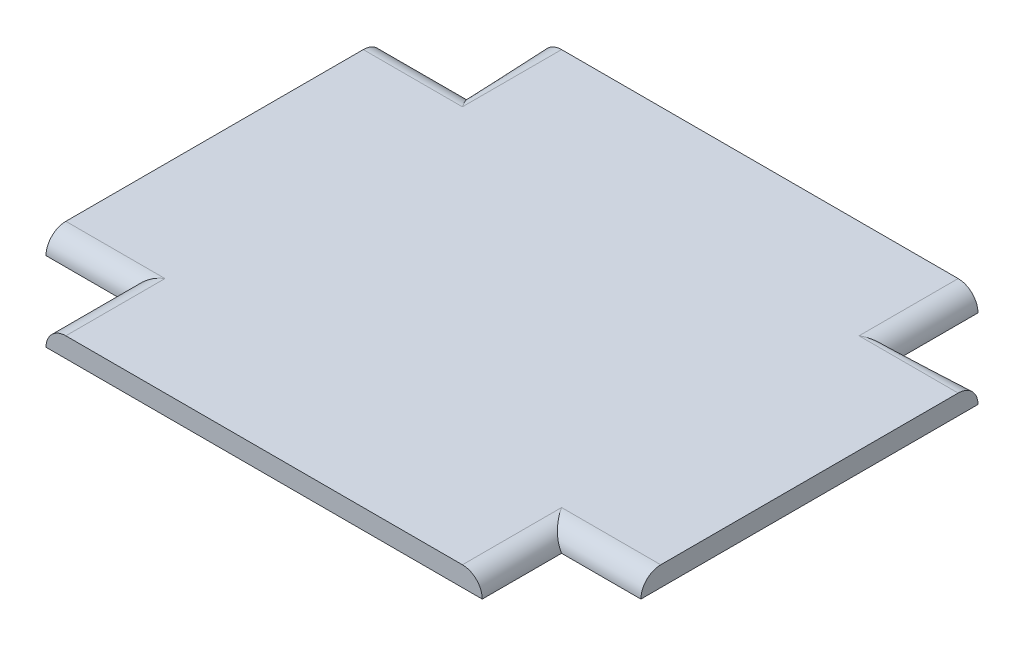
ISO-10303-21;
HEADER;
FILE_DESCRIPTION(('STEP AP214'),'2;1');
FILE_NAME('part.step','',(''),(''),'','','');
FILE_SCHEMA(('AUTOMOTIVE_DESIGN { 1 0 10303 214 1 1 1 1 }'));
ENDSEC;
DATA;
#1=APPLICATION_CONTEXT('core data for automotive mechanical design processes');
#2=APPLICATION_PROTOCOL_DEFINITION('international standard','automotive_design',2000,#1);
#3=PRODUCT_CONTEXT('',#1,'mechanical');
#4=PRODUCT('Part','Part','',(#3));
#5=PRODUCT_RELATED_PRODUCT_CATEGORY('part','',(#4));
#6=PRODUCT_DEFINITION_FORMATION('','',#4);
#7=PRODUCT_DEFINITION_CONTEXT('part definition',#1,'design');
#8=PRODUCT_DEFINITION('design','',#6,#7);
#9=PRODUCT_DEFINITION_SHAPE('','',#8);
#10=(LENGTH_UNIT() NAMED_UNIT(*) SI_UNIT(.MILLI.,.METRE.));
#11=(NAMED_UNIT(*) PLANE_ANGLE_UNIT() SI_UNIT($,.RADIAN.));
#12=(NAMED_UNIT(*) SI_UNIT($,.STERADIAN.) SOLID_ANGLE_UNIT());
#13=UNCERTAINTY_MEASURE_WITH_UNIT(LENGTH_MEASURE(1.E-05),#10,'distance_accuracy_value','');
#14=(GEOMETRIC_REPRESENTATION_CONTEXT(3) GLOBAL_UNCERTAINTY_ASSIGNED_CONTEXT((#13)) GLOBAL_UNIT_ASSIGNED_CONTEXT((#10,
#11,#12)) REPRESENTATION_CONTEXT('',''));
#15=CARTESIAN_POINT('',(0.,0.,0.));
#16=DIRECTION('',(0.,0.,1.));
#17=DIRECTION('',(1.,0.,0.));
#18=AXIS2_PLACEMENT_3D('',#15,#16,#17);
#19=CARTESIAN_POINT('',(-0.2,0.18,0.21));
#20=DIRECTION('',(0.,0.,1.));
#21=DIRECTION('',(-0.707106781186548,0.707106781186548,0.));
#22=AXIS2_PLACEMENT_3D('',#19,#20,#21);
#23=CYLINDRICAL_SURFACE('',#22,0.02);
#24=DIRECTION('',(0.,0.,-1.));
#25=VECTOR('',#24,1.);
#26=CARTESIAN_POINT('',(-0.22,0.18,0.21));
#27=LINE('',#26,#25);
#28=CARTESIAN_POINT('',(-0.22,0.18,0.5));
#29=VERTEX_POINT('',#28);
#30=CARTESIAN_POINT('',(-0.22,0.18,0.42));
#31=VERTEX_POINT('',#30);
#32=EDGE_CURVE('E11',#29,#31,#27,.T.);
#33=ORIENTED_EDGE('',*,*,#32,.F.);
#34=CARTESIAN_POINT('',(-0.2,0.18,0.5));
#35=DIRECTION('',(0.,0.,-1.));
#36=DIRECTION('',(-0.707106781186548,0.707106781186548,0.));
#37=AXIS2_PLACEMENT_3D('',#34,#35,#36);
#38=CIRCLE('',#37,0.02);
#39=CARTESIAN_POINT('',(-0.2,0.2,0.5));
#40=VERTEX_POINT('',#39);
#41=EDGE_CURVE('E25',#29,#40,#38,.T.);
#42=ORIENTED_EDGE('',*,*,#41,.T.);
#43=DIRECTION('',(0.,0.,-1.));
#44=VECTOR('',#43,1.);
#45=CARTESIAN_POINT('',(-0.2,0.2,0.21));
#46=LINE('',#45,#44);
#47=CARTESIAN_POINT('',(-0.2,0.2,0.4));
#48=VERTEX_POINT('',#47);
#49=EDGE_CURVE('E294',#40,#48,#46,.T.);
#50=ORIENTED_EDGE('',*,*,#49,.T.);
#51=CARTESIAN_POINT('',(-0.2,0.2,0.4));
#52=CARTESIAN_POINT('',(-0.200327249565218,0.200000006941775,0.400208333333333));
#53=CARTESIAN_POINT('',(-0.200654498539759,0.199991968342503,0.400416666666667));
#54=CARTESIAN_POINT('',(-0.201308208433338,0.199959849905704,0.400833333333333));
#55=CARTESIAN_POINT('',(-0.201634669352377,0.199935770068177,0.401041666666667));
#56=CARTESIAN_POINT('',(-0.202286016260805,0.199871618998711,0.401458333333333));
#57=CARTESIAN_POINT('',(-0.202610902250195,0.199831547766771,0.401666666666667));
#58=CARTESIAN_POINT('',(-0.20325831672802,0.19973551263182,0.402083333333333));
#59=CARTESIAN_POINT('',(-0.203580845216455,0.199679548728808,0.402291666666667));
#60=CARTESIAN_POINT('',(-0.20422276766419,0.199551862487321,0.402708333333333));
#61=CARTESIAN_POINT('',(-0.204542161623488,0.199480140148846,0.402916666666667));
#62=CARTESIAN_POINT('',(-0.205177045572642,0.199321109978936,0.403333333333333));
#63=CARTESIAN_POINT('',(-0.205492535562498,0.199233802147501,0.403541666666667));
#64=CARTESIAN_POINT('',(-0.20611885152768,0.199043811281787,0.403958333333333));
#65=CARTESIAN_POINT('',(-0.206429677503006,0.198941128247509,0.404166666666667));
#66=CARTESIAN_POINT('',(-0.207045916632683,0.198720634359812,0.404583333333333));
#67=CARTESIAN_POINT('',(-0.207351329787033,0.198602823506393,0.404791666666667));
#68=CARTESIAN_POINT('',(-0.20795600750757,0.198352357794058,0.405208333333333));
#69=CARTESIAN_POINT('',(-0.208255272073757,0.198219702935142,0.405416666666667));
#70=CARTESIAN_POINT('',(-0.208846931663454,0.197939868789796,0.405833333333333));
#71=CARTESIAN_POINT('',(-0.209139326686964,0.197792689503366,0.406041666666667));
#72=CARTESIAN_POINT('',(-0.209716542786075,0.197484161070568,0.406458333333333));
#73=CARTESIAN_POINT('',(-0.210001363861676,0.1973228119242,0.406666666666667));
#74=CARTESIAN_POINT('',(-0.210562745906053,0.196986332475811,0.407083333333333));
#75=CARTESIAN_POINT('',(-0.210839306874828,0.196811202173789,0.407291666666667));
#76=CARTESIAN_POINT('',(-0.211383502445956,0.196447582318313,0.407708333333333));
#77=CARTESIAN_POINT('',(-0.211651137048308,0.196259092764859,0.407916666666667));
#78=CARTESIAN_POINT('',(-0.212176835131389,0.195869208494367,0.408333333333333));
#79=CARTESIAN_POINT('',(-0.212434898612119,0.195667813777329,0.408541666666667));
#80=CARTESIAN_POINT('',(-0.212940832754427,0.195252604357181,0.408958333333333));
#81=CARTESIAN_POINT('',(-0.213188703416005,0.195038789654071,0.409166666666667));
#82=CARTESIAN_POINT('',(-0.213673654777876,0.194599255360127,0.409583333333333));
#83=CARTESIAN_POINT('',(-0.213910735478168,0.194373535769294,0.409791666666667));
#84=CARTESIAN_POINT('',(-0.214373535769294,0.193910735478168,0.410208333333333));
#85=CARTESIAN_POINT('',(-0.214599255360127,0.193673654777876,0.410416666666667));
#86=CARTESIAN_POINT('',(-0.215038789654071,0.193188703416005,0.410833333333333));
#87=CARTESIAN_POINT('',(-0.215252604357181,0.192940832754427,0.411041666666667));
#88=CARTESIAN_POINT('',(-0.215667813777329,0.192434898612119,0.411458333333333));
#89=CARTESIAN_POINT('',(-0.215869208494367,0.192176835131389,0.411666666666667));
#90=CARTESIAN_POINT('',(-0.216259092764859,0.191651137048308,0.412083333333333));
#91=CARTESIAN_POINT('',(-0.216447582318313,0.191383502445956,0.412291666666667));
#92=CARTESIAN_POINT('',(-0.216811202173789,0.190839306874828,0.412708333333333));
#93=CARTESIAN_POINT('',(-0.216986332475811,0.190562745906053,0.412916666666667));
#94=CARTESIAN_POINT('',(-0.2173228119242,0.190001363861676,0.413333333333333));
#95=CARTESIAN_POINT('',(-0.217484161070568,0.189716542786075,0.413541666666667));
#96=CARTESIAN_POINT('',(-0.217792689503366,0.189139326686964,0.413958333333333));
#97=CARTESIAN_POINT('',(-0.217939868789796,0.188846931663454,0.414166666666667));
#98=CARTESIAN_POINT('',(-0.218219702935142,0.188255272073757,0.414583333333333));
#99=CARTESIAN_POINT('',(-0.218352357794058,0.18795600750757,0.414791666666667));
#100=CARTESIAN_POINT('',(-0.218602823506393,0.187351329787033,0.415208333333333));
#101=CARTESIAN_POINT('',(-0.218720634359812,0.187045916632683,0.415416666666667));
#102=CARTESIAN_POINT('',(-0.218941128247509,0.186429677503006,0.415833333333333));
#103=CARTESIAN_POINT('',(-0.219043811281787,0.18611885152768,0.416041666666667));
#104=CARTESIAN_POINT('',(-0.219233802147501,0.185492535562498,0.416458333333333));
#105=CARTESIAN_POINT('',(-0.219321109978936,0.185177045572642,0.416666666666667));
#106=CARTESIAN_POINT('',(-0.219480140148846,0.184542161623488,0.417083333333333));
#107=CARTESIAN_POINT('',(-0.219551862487321,0.18422276766419,0.417291666666667));
#108=CARTESIAN_POINT('',(-0.219679548728808,0.183580845216455,0.417708333333333));
#109=CARTESIAN_POINT('',(-0.21973551263182,0.18325831672802,0.417916666666667));
#110=CARTESIAN_POINT('',(-0.219831547766771,0.182610902250195,0.418333333333333));
#111=CARTESIAN_POINT('',(-0.219871618998711,0.182286016260805,0.418541666666667));
#112=CARTESIAN_POINT('',(-0.219935770068177,0.181634669352377,0.418958333333333));
#113=CARTESIAN_POINT('',(-0.219959849905704,0.181308208433338,0.419166666666667));
#114=CARTESIAN_POINT('',(-0.219991968342503,0.180654498539759,0.419583333333333));
#115=CARTESIAN_POINT('',(-0.220000006941776,0.180327249565218,0.419791666666667));
#116=CARTESIAN_POINT('',(-0.22,0.18,0.42));
#117=B_SPLINE_CURVE_WITH_KNOTS('',3,(#51,#52,#53,#54,#55,#56,#57,#58,#59,#60,#61,#62,#63,#64,
#65,#66,#67,#68,#69,#70,#71,#72,#73,#74,#75,#76,#77,#78,#79,#80,#81,#82,#83,#84,#85,#86,#87,#88,
#89,#90,#91,#92,#93,#94,#95,#96,#97,#98,#99,#100,#101,#102,#103,#104,#105,#106,#107,#108,#109,
#110,#111,#112,#113,#114,#115,#116),.UNSPECIFIED.,.F.,.F.,(4,2,2,2,2,2,2,2,2,2,2,2,2,2,2,2,2,2,
2,2,2,2,2,2,2,2,2,2,2,2,2,2,4),(0.,0.00116372678746432,0.00232745357492866,0.00349118036239302,
0.00465490714985738,0.00581863393732172,0.00698236072478605,0.00814608751225039,
0.00930981429971474,0.0104735410871791,0.0116372678746434,0.0128009946621078,0.0139647214495722,
0.0151284482370365,0.0162921750245008,0.0174559018119652,0.0186196285994295,0.0197833553868939,
0.0209470821743582,0.0221108089618226,0.023274535749287,0.0244382625367513,0.0256019893242156,
0.0267657161116799,0.0279294428991443,0.0290931696866087,0.030256896474073,0.0314206232615373,
0.0325843500490017,0.033748076836466,0.0349118036239304,0.0360755304113947,0.0372392571988591),.UNSPECIFIED.);
#118=EDGE_CURVE('E281',#48,#31,#117,.T.);
#119=ORIENTED_EDGE('',*,*,#118,.T.);
#120=EDGE_LOOP('',(#33,#42,#50,#119));
#121=FACE_BOUND('',#120,.T.);
#122=ADVANCED_FACE('F17',(#121),#23,.T.);
#123=CARTESIAN_POINT('',(0.,0.18,0.4));
#124=DIRECTION('',(1.,0.,0.));
#125=DIRECTION('',(0.,0.707106781186548,0.707106781186548));
#126=AXIS2_PLACEMENT_3D('',#123,#124,#125);
#127=CYLINDRICAL_SURFACE('',#126,0.02);
#128=DIRECTION('',(-1.,0.,0.));
#129=VECTOR('',#128,1.);
#130=CARTESIAN_POINT('',(0.,0.2,0.4));
#131=LINE('',#130,#129);
#132=CARTESIAN_POINT('',(-0.3,0.2,0.4));
#133=VERTEX_POINT('',#132);
#134=EDGE_CURVE('E271',#48,#133,#131,.T.);
#135=ORIENTED_EDGE('',*,*,#134,.T.);
#136=CARTESIAN_POINT('',(-0.3,0.18,0.4));
#137=DIRECTION('',(1.,0.,0.));
#138=DIRECTION('',(0.,0.707106781186548,0.707106781186548));
#139=AXIS2_PLACEMENT_3D('',#136,#137,#138);
#140=CIRCLE('',#139,0.02);
#141=CARTESIAN_POINT('',(-0.3,0.18,0.42));
#142=VERTEX_POINT('',#141);
#143=EDGE_CURVE('E317',#133,#142,#140,.T.);
#144=ORIENTED_EDGE('',*,*,#143,.T.);
#145=DIRECTION('',(-1.,0.,0.));
#146=VECTOR('',#145,1.);
#147=CARTESIAN_POINT('',(-0.3,0.18,0.42));
#148=LINE('',#147,#146);
#149=EDGE_CURVE('E313',#31,#142,#148,.T.);
#150=ORIENTED_EDGE('',*,*,#149,.F.);
#151=ORIENTED_EDGE('',*,*,#118,.F.);
#152=EDGE_LOOP('',(#135,#144,#150,#151));
#153=FACE_BOUND('',#152,.T.);
#154=ADVANCED_FACE('F261',(#153),#127,.T.);
#155=CARTESIAN_POINT('',(-0.3,0.2,0.));
#156=DIRECTION('',(-1.,0.,0.));
#157=DIRECTION('',(0.,-1.,0.));
#158=AXIS2_PLACEMENT_3D('',#155,#156,#157);
#159=PLANE('',#158);
#160=ORIENTED_EDGE('',*,*,#143,.F.);
#161=DIRECTION('',(0.,0.,1.));
#162=VECTOR('',#161,1.);
#163=CARTESIAN_POINT('',(-0.3,0.2,0.));
#164=LINE('',#163,#162);
#165=CARTESIAN_POINT('',(-0.3,0.2,0.1));
#166=VERTEX_POINT('',#165);
#167=EDGE_CURVE('E311',#166,#133,#164,.T.);
#168=ORIENTED_EDGE('',*,*,#167,.F.);
#169=CARTESIAN_POINT('',(-0.3,0.18,0.1));
#170=DIRECTION('',(1.,0.,0.));
#171=DIRECTION('',(0.,0.707106781186548,-0.707106781186547));
#172=AXIS2_PLACEMENT_3D('',#169,#170,#171);
#173=CIRCLE('',#172,0.02);
#174=CARTESIAN_POINT('',(-0.3,0.18,0.08));
#175=VERTEX_POINT('',#174);
#176=EDGE_CURVE('E303',#175,#166,#173,.T.);
#177=ORIENTED_EDGE('',*,*,#176,.F.);
#178=DIRECTION('',(0.,0.,1.));
#179=VECTOR('',#178,1.);
#180=CARTESIAN_POINT('',(-0.3,0.18,0.));
#181=LINE('',#180,#179);
#182=EDGE_CURVE('E300',#175,#142,#181,.T.);
#183=ORIENTED_EDGE('',*,*,#182,.T.);
#184=EDGE_LOOP('',(#160,#168,#177,#183));
#185=FACE_BOUND('',#184,.T.);
#186=ADVANCED_FACE('F258',(#185),#159,.T.);
#187=CARTESIAN_POINT('',(0.3,0.2,0.));
#188=DIRECTION('',(0.,1.,0.));
#189=DIRECTION('',(-1.,0.,0.));
#190=AXIS2_PLACEMENT_3D('',#187,#188,#189);
#191=PLANE('',#190);
#192=ORIENTED_EDGE('',*,*,#134,.F.);
#193=ORIENTED_EDGE('',*,*,#49,.F.);
#194=DIRECTION('',(-1.,0.,0.));
#195=VECTOR('',#194,1.);
#196=CARTESIAN_POINT('',(0.3,0.2,0.5));
#197=LINE('',#196,#195);
#198=CARTESIAN_POINT('',(0.2,0.2,0.5));
#199=VERTEX_POINT('',#198);
#200=EDGE_CURVE('E298',#199,#40,#197,.T.);
#201=ORIENTED_EDGE('',*,*,#200,.F.);
#202=DIRECTION('',(0.,0.,1.));
#203=VECTOR('',#202,1.);
#204=CARTESIAN_POINT('',(0.2,0.2,0.25));
#205=LINE('',#204,#203);
#206=CARTESIAN_POINT('',(0.2,0.2,0.4));
#207=VERTEX_POINT('',#206);
#208=EDGE_CURVE('E109',#207,#199,#205,.T.);
#209=ORIENTED_EDGE('',*,*,#208,.F.);
#210=DIRECTION('',(-1.,0.,0.));
#211=VECTOR('',#210,1.);
#212=CARTESIAN_POINT('',(0.26,0.2,0.4));
#213=LINE('',#212,#211);
#214=CARTESIAN_POINT('',(0.3,0.2,0.4));
#215=VERTEX_POINT('',#214);
#216=EDGE_CURVE('E305',#215,#207,#213,.T.);
#217=ORIENTED_EDGE('',*,*,#216,.F.);
#218=DIRECTION('',(0.,0.,1.));
#219=VECTOR('',#218,1.);
#220=CARTESIAN_POINT('',(0.3,0.2,0.));
#221=LINE('',#220,#219);
#222=CARTESIAN_POINT('',(0.3,0.2,0.1));
#223=VERTEX_POINT('',#222);
#224=EDGE_CURVE('E345',#223,#215,#221,.T.);
#225=ORIENTED_EDGE('',*,*,#224,.F.);
#226=DIRECTION('',(1.,0.,0.));
#227=VECTOR('',#226,1.);
#228=CARTESIAN_POINT('',(0.3,0.2,0.1));
#229=LINE('',#228,#227);
#230=CARTESIAN_POINT('',(0.2,0.2,0.1));
#231=VERTEX_POINT('',#230);
#232=EDGE_CURVE('E340',#231,#223,#229,.T.);
#233=ORIENTED_EDGE('',*,*,#232,.F.);
#234=DIRECTION('',(0.,0.,1.));
#235=VECTOR('',#234,1.);
#236=CARTESIAN_POINT('',(0.2,0.2,0.04));
#237=LINE('',#236,#235);
#238=CARTESIAN_POINT('',(0.2,0.2,0.));
#239=VERTEX_POINT('',#238);
#240=EDGE_CURVE('E336',#239,#231,#237,.T.);
#241=ORIENTED_EDGE('',*,*,#240,.F.);
#242=DIRECTION('',(-1.,0.,0.));
#243=VECTOR('',#242,1.);
#244=CARTESIAN_POINT('',(0.3,0.2,0.));
#245=LINE('',#244,#243);
#246=CARTESIAN_POINT('',(-0.2,0.2,0.));
#247=VERTEX_POINT('',#246);
#248=EDGE_CURVE('E327',#239,#247,#245,.T.);
#249=ORIENTED_EDGE('',*,*,#248,.T.);
#250=DIRECTION('',(0.,0.,-1.));
#251=VECTOR('',#250,1.);
#252=CARTESIAN_POINT('',(-0.2,0.2,0.));
#253=LINE('',#252,#251);
#254=CARTESIAN_POINT('',(-0.2,0.2,0.1));
#255=VERTEX_POINT('',#254);
#256=EDGE_CURVE('E324',#255,#247,#253,.T.);
#257=ORIENTED_EDGE('',*,*,#256,.F.);
#258=DIRECTION('',(1.,0.,0.));
#259=VECTOR('',#258,1.);
#260=CARTESIAN_POINT('',(0.0399999999999999,0.2,0.1));
#261=LINE('',#260,#259);
#262=EDGE_CURVE('E323',#166,#255,#261,.T.);
#263=ORIENTED_EDGE('',*,*,#262,.F.);
#264=ORIENTED_EDGE('',*,*,#167,.T.);
#265=EDGE_LOOP('',(#192,#193,#201,#209,#217,#225,#233,#241,#249,#257,#263,#264));
#266=FACE_BOUND('',#265,.T.);
#267=ADVANCED_FACE('F254',(#266),#191,.T.);
#268=CARTESIAN_POINT('',(0.0399999999999999,0.18,0.1));
#269=DIRECTION('',(-1.,0.,0.));
#270=DIRECTION('',(0.,0.707106781186548,-0.707106781186547));
#271=AXIS2_PLACEMENT_3D('',#268,#269,#270);
#272=CYLINDRICAL_SURFACE('',#271,0.02);
#273=DIRECTION('',(1.,0.,0.));
#274=VECTOR('',#273,1.);
#275=CARTESIAN_POINT('',(-0.26,0.18,0.08));
#276=LINE('',#275,#274);
#277=CARTESIAN_POINT('',(-0.22,0.18,0.08));
#278=VERTEX_POINT('',#277);
#279=EDGE_CURVE('E325',#175,#278,#276,.T.);
#280=ORIENTED_EDGE('',*,*,#279,.F.);
#281=ORIENTED_EDGE('',*,*,#176,.T.);
#282=ORIENTED_EDGE('',*,*,#262,.T.);
#283=CARTESIAN_POINT('',(-0.2,0.2,0.1));
#284=CARTESIAN_POINT('',(-0.200208333333333,0.200000006941775,0.0996727504347822));
#285=CARTESIAN_POINT('',(-0.200416666666667,0.199991968342503,0.0993455014602415));
#286=CARTESIAN_POINT('',(-0.200833333333333,0.199959849905704,0.0986917915666618));
#287=CARTESIAN_POINT('',(-0.201041666666667,0.199935770068177,0.0983653306476229));
#288=CARTESIAN_POINT('',(-0.201458333333333,0.199871618998711,0.0977139837391947));
#289=CARTESIAN_POINT('',(-0.201666666666667,0.199831547766771,0.0973890977498053));
#290=CARTESIAN_POINT('',(-0.202083333333333,0.19973551263182,0.0967416832719802));
#291=CARTESIAN_POINT('',(-0.202291666666667,0.199679548728808,0.0964191547835445));
#292=CARTESIAN_POINT('',(-0.202708333333333,0.199551862487321,0.0957772323358103));
#293=CARTESIAN_POINT('',(-0.202916666666667,0.199480140148846,0.0954578383765119));
#294=CARTESIAN_POINT('',(-0.203333333333333,0.199321109978936,0.0948229544273576));
#295=CARTESIAN_POINT('',(-0.203541666666667,0.199233802147501,0.0945074644375017));
#296=CARTESIAN_POINT('',(-0.203958333333333,0.199043811281787,0.0938811484723198));
#297=CARTESIAN_POINT('',(-0.204166666666667,0.198941128247509,0.0935703224969938));
#298=CARTESIAN_POINT('',(-0.204583333333333,0.198720634359812,0.0929540833673173));
#299=CARTESIAN_POINT('',(-0.204791666666667,0.198602823506393,0.0926486702129668));
#300=CARTESIAN_POINT('',(-0.205208333333333,0.198352357794058,0.0920439924924296));
#301=CARTESIAN_POINT('',(-0.205416666666667,0.198219702935142,0.0917447279262428));
#302=CARTESIAN_POINT('',(-0.205833333333333,0.197939868789796,0.0911530683365458));
#303=CARTESIAN_POINT('',(-0.206041666666667,0.197792689503366,0.0908606733130356));
#304=CARTESIAN_POINT('',(-0.206458333333333,0.197484161070568,0.0902834572139245));
#305=CARTESIAN_POINT('',(-0.206666666666667,0.1973228119242,0.0899986361383237));
#306=CARTESIAN_POINT('',(-0.207083333333333,0.196986332475811,0.0894372540939474));
#307=CARTESIAN_POINT('',(-0.207291666666667,0.196811202173789,0.0891606931251718));
#308=CARTESIAN_POINT('',(-0.207708333333333,0.196447582318313,0.0886164975540441));
#309=CARTESIAN_POINT('',(-0.207916666666667,0.196259092764859,0.0883488629516921));
#310=CARTESIAN_POINT('',(-0.208333333333333,0.195869208494367,0.0878231648686106));
#311=CARTESIAN_POINT('',(-0.208541666666667,0.195667813777329,0.087565101387881));
#312=CARTESIAN_POINT('',(-0.208958333333333,0.195252604357181,0.0870591672455732));
#313=CARTESIAN_POINT('',(-0.209166666666667,0.195038789654071,0.0868112965839949));
#314=CARTESIAN_POINT('',(-0.209583333333333,0.194599255360127,0.0863263452221243));
#315=CARTESIAN_POINT('',(-0.209791666666667,0.194373535769294,0.086089264521832));
#316=CARTESIAN_POINT('',(-0.210208333333333,0.193910735478168,0.0856264642307061));
#317=CARTESIAN_POINT('',(-0.210416666666667,0.193673654777876,0.0854007446398725));
#318=CARTESIAN_POINT('',(-0.210833333333333,0.193188703416005,0.0849612103459291));
#319=CARTESIAN_POINT('',(-0.211041666666667,0.192940832754427,0.0847473956428192));
#320=CARTESIAN_POINT('',(-0.211458333333333,0.192434898612119,0.0843321862226713));
#321=CARTESIAN_POINT('',(-0.211666666666667,0.192176835131389,0.0841307915056332));
#322=CARTESIAN_POINT('',(-0.212083333333333,0.191651137048308,0.083740907235141));
#323=CARTESIAN_POINT('',(-0.212291666666667,0.191383502445956,0.083552417681687));
#324=CARTESIAN_POINT('',(-0.212708333333333,0.190839306874828,0.0831887978262112));
#325=CARTESIAN_POINT('',(-0.212916666666667,0.190562745906053,0.0830136675241894));
#326=CARTESIAN_POINT('',(-0.213333333333333,0.190001363861676,0.0826771880757997));
#327=CARTESIAN_POINT('',(-0.213541666666667,0.189716542786075,0.0825158389294318));
#328=CARTESIAN_POINT('',(-0.213958333333333,0.189139326686964,0.082207310496634));
#329=CARTESIAN_POINT('',(-0.214166666666667,0.188846931663454,0.0820601312102042));
#330=CARTESIAN_POINT('',(-0.214583333333333,0.188255272073757,0.0817802970648581));
#331=CARTESIAN_POINT('',(-0.214791666666667,0.18795600750757,0.0816476422059417));
#332=CARTESIAN_POINT('',(-0.215208333333333,0.187351329787033,0.0813971764936068));
#333=CARTESIAN_POINT('',(-0.215416666666667,0.187045916632683,0.0812793656401881));
#334=CARTESIAN_POINT('',(-0.215833333333333,0.186429677503006,0.081058871752491));
#335=CARTESIAN_POINT('',(-0.216041666666667,0.18611885152768,0.0809561887182125));
#336=CARTESIAN_POINT('',(-0.216458333333333,0.185492535562498,0.0807661978524991));
#337=CARTESIAN_POINT('',(-0.216666666666667,0.185177045572642,0.0806788900210642));
#338=CARTESIAN_POINT('',(-0.217083333333333,0.184542161623488,0.0805198598511541));
#339=CARTESIAN_POINT('',(-0.217291666666667,0.18422276766419,0.0804481375126789));
#340=CARTESIAN_POINT('',(-0.217708333333333,0.183580845216455,0.0803204512711919));
#341=CARTESIAN_POINT('',(-0.217916666666667,0.18325831672802,0.0802644873681801));
#342=CARTESIAN_POINT('',(-0.218333333333333,0.182610902250195,0.0801684522332287));
#343=CARTESIAN_POINT('',(-0.218541666666667,0.182286016260805,0.0801283810012892));
#344=CARTESIAN_POINT('',(-0.218958333333333,0.181634669352377,0.0800642299318229));
#345=CARTESIAN_POINT('',(-0.219166666666667,0.181308208433338,0.0800401500942962));
#346=CARTESIAN_POINT('',(-0.219583333333333,0.180654498539759,0.080008031657497));
#347=CARTESIAN_POINT('',(-0.219791666666667,0.180327249565218,0.0799999930582245));
#348=CARTESIAN_POINT('',(-0.22,0.18,0.08));
#349=B_SPLINE_CURVE_WITH_KNOTS('',3,(#283,#284,#285,#286,#287,#288,#289,#290,#291,#292,#293,
#294,#295,#296,#297,#298,#299,#300,#301,#302,#303,#304,#305,#306,#307,#308,#309,#310,#311,#312,
#313,#314,#315,#316,#317,#318,#319,#320,#321,#322,#323,#324,#325,#326,#327,#328,#329,#330,#331,
#332,#333,#334,#335,#336,#337,#338,#339,#340,#341,#342,#343,#344,#345,#346,#347,#348),
.UNSPECIFIED.,.F.,.F.,(4,2,2,2,2,2,2,2,2,2,2,2,2,2,2,2,2,2,2,2,2,2,2,2,2,2,2,2,2,2,2,2,4),(0.,
0.00116372678746435,0.0023274535749287,0.00349118036239303,0.00465490714985738,
0.00581863393732173,0.00698236072478608,0.0081460875122504,0.00930981429971476,
0.0104735410871791,0.0116372678746435,0.0128009946621078,0.0139647214495721,0.0151284482370365,
0.0162921750245008,0.0174559018119652,0.0186196285994295,0.0197833553868938,0.0209470821743582,
0.0221108089618226,0.0232745357492869,0.0244382625367512,0.0256019893242156,0.0267657161116799,
0.0279294428991443,0.0290931696866086,0.030256896474073,0.0314206232615373,0.0325843500490016,
0.033748076836466,0.0349118036239304,0.0360755304113947,0.037239257198859),.UNSPECIFIED.);
#350=EDGE_CURVE('E226',#255,#278,#349,.T.);
#351=ORIENTED_EDGE('',*,*,#350,.T.);
#352=EDGE_LOOP('',(#280,#281,#282,#351));
#353=FACE_BOUND('',#352,.T.);
#354=ADVANCED_FACE('F245',(#353),#272,.T.);
#355=CARTESIAN_POINT('',(-0.2,0.18,0.));
#356=DIRECTION('',(0.,0.,1.));
#357=DIRECTION('',(-0.707106781186548,0.707106781186548,0.));
#358=AXIS2_PLACEMENT_3D('',#355,#356,#357);
#359=CYLINDRICAL_SURFACE('',#358,0.02);
#360=ORIENTED_EDGE('',*,*,#256,.T.);
#361=CARTESIAN_POINT('',(-0.2,0.18,0.));
#362=DIRECTION('',(0.,0.,1.));
#363=DIRECTION('',(-0.707106781186548,0.707106781186548,0.));
#364=AXIS2_PLACEMENT_3D('',#361,#362,#363);
#365=CIRCLE('',#364,0.02);
#366=CARTESIAN_POINT('',(-0.22,0.18,0.));
#367=VERTEX_POINT('',#366);
#368=EDGE_CURVE('E224',#247,#367,#365,.T.);
#369=ORIENTED_EDGE('',*,*,#368,.T.);
#370=DIRECTION('',(0.,0.,-1.));
#371=VECTOR('',#370,1.);
#372=CARTESIAN_POINT('',(-0.22,0.18,0.));
#373=LINE('',#372,#371);
#374=EDGE_CURVE('E219',#278,#367,#373,.T.);
#375=ORIENTED_EDGE('',*,*,#374,.F.);
#376=ORIENTED_EDGE('',*,*,#350,.F.);
#377=EDGE_LOOP('',(#360,#369,#375,#376));
#378=FACE_BOUND('',#377,.T.);
#379=ADVANCED_FACE('F196',(#378),#359,.T.);
#380=CARTESIAN_POINT('',(0.2,0.18,0.04));
#381=DIRECTION('',(0.,0.,-1.));
#382=DIRECTION('',(0.707106781186548,0.707106781186548,0.));
#383=AXIS2_PLACEMENT_3D('',#380,#381,#382);
#384=CYLINDRICAL_SURFACE('',#383,0.02);
#385=DIRECTION('',(0.,0.,1.));
#386=VECTOR('',#385,1.);
#387=CARTESIAN_POINT('',(0.22,0.18,0.04));
#388=LINE('',#387,#386);
#389=CARTESIAN_POINT('',(0.22,0.18,0.));
#390=VERTEX_POINT('',#389);
#391=CARTESIAN_POINT('',(0.22,0.18,0.0800000000000001));
#392=VERTEX_POINT('',#391);
#393=EDGE_CURVE('E215',#390,#392,#388,.T.);
#394=ORIENTED_EDGE('',*,*,#393,.F.);
#395=CARTESIAN_POINT('',(0.2,0.18,0.));
#396=DIRECTION('',(0.,0.,1.));
#397=DIRECTION('',(0.707106781186548,0.707106781186548,0.));
#398=AXIS2_PLACEMENT_3D('',#395,#396,#397);
#399=CIRCLE('',#398,0.02);
#400=EDGE_CURVE('E212',#390,#239,#399,.T.);
#401=ORIENTED_EDGE('',*,*,#400,.T.);
#402=ORIENTED_EDGE('',*,*,#240,.T.);
#403=CARTESIAN_POINT('',(0.2,0.2,0.1));
#404=CARTESIAN_POINT('',(0.200327249565218,0.200000006941775,0.0997916666666667));
#405=CARTESIAN_POINT('',(0.200654498539759,0.199991968342503,0.0995833333333333));
#406=CARTESIAN_POINT('',(0.201308208433338,0.199959849905704,0.0991666666666667));
#407=CARTESIAN_POINT('',(0.201634669352377,0.199935770068177,0.0989583333333333));
#408=CARTESIAN_POINT('',(0.202286016260805,0.199871618998711,0.0985416666666667));
#409=CARTESIAN_POINT('',(0.202610902250195,0.199831547766771,0.0983333333333333));
#410=CARTESIAN_POINT('',(0.20325831672802,0.19973551263182,0.0979166666666667));
#411=CARTESIAN_POINT('',(0.203580845216455,0.199679548728808,0.0977083333333333));
#412=CARTESIAN_POINT('',(0.20422276766419,0.199551862487321,0.0972916666666667));
#413=CARTESIAN_POINT('',(0.204542161623488,0.199480140148846,0.0970833333333333));
#414=CARTESIAN_POINT('',(0.205177045572642,0.199321109978936,0.0966666666666667));
#415=CARTESIAN_POINT('',(0.205492535562498,0.199233802147501,0.0964583333333333));
#416=CARTESIAN_POINT('',(0.20611885152768,0.199043811281787,0.0960416666666667));
#417=CARTESIAN_POINT('',(0.206429677503006,0.198941128247509,0.0958333333333333));
#418=CARTESIAN_POINT('',(0.207045916632683,0.198720634359812,0.0954166666666667));
#419=CARTESIAN_POINT('',(0.207351329787033,0.198602823506393,0.0952083333333334));
#420=CARTESIAN_POINT('',(0.20795600750757,0.198352357794058,0.0947916666666667));
#421=CARTESIAN_POINT('',(0.208255272073757,0.198219702935142,0.0945833333333333));
#422=CARTESIAN_POINT('',(0.208846931663454,0.197939868789796,0.0941666666666667));
#423=CARTESIAN_POINT('',(0.209139326686964,0.197792689503366,0.0939583333333334));
#424=CARTESIAN_POINT('',(0.209716542786075,0.197484161070568,0.0935416666666667));
#425=CARTESIAN_POINT('',(0.210001363861676,0.1973228119242,0.0933333333333334));
#426=CARTESIAN_POINT('',(0.210562745906053,0.196986332475811,0.0929166666666667));
#427=CARTESIAN_POINT('',(0.210839306874828,0.196811202173789,0.0927083333333334));
#428=CARTESIAN_POINT('',(0.211383502445956,0.196447582318313,0.0922916666666667));
#429=CARTESIAN_POINT('',(0.211651137048308,0.196259092764859,0.0920833333333334));
#430=CARTESIAN_POINT('',(0.212176835131389,0.195869208494367,0.0916666666666667));
#431=CARTESIAN_POINT('',(0.212434898612119,0.195667813777329,0.0914583333333334));
#432=CARTESIAN_POINT('',(0.212940832754427,0.195252604357181,0.0910416666666667));
#433=CARTESIAN_POINT('',(0.213188703416005,0.195038789654071,0.0908333333333333));
#434=CARTESIAN_POINT('',(0.213673654777876,0.194599255360127,0.0904166666666667));
#435=CARTESIAN_POINT('',(0.213910735478168,0.194373535769294,0.0902083333333333));
#436=CARTESIAN_POINT('',(0.214373535769294,0.193910735478168,0.0897916666666667));
#437=CARTESIAN_POINT('',(0.214599255360127,0.193673654777876,0.0895833333333333));
#438=CARTESIAN_POINT('',(0.215038789654071,0.193188703416005,0.0891666666666667));
#439=CARTESIAN_POINT('',(0.215252604357181,0.192940832754427,0.0889583333333333));
#440=CARTESIAN_POINT('',(0.215667813777329,0.192434898612119,0.0885416666666667));
#441=CARTESIAN_POINT('',(0.215869208494367,0.192176835131389,0.0883333333333333));
#442=CARTESIAN_POINT('',(0.216259092764859,0.191651137048308,0.0879166666666667));
#443=CARTESIAN_POINT('',(0.216447582318313,0.191383502445956,0.0877083333333334));
#444=CARTESIAN_POINT('',(0.216811202173789,0.190839306874828,0.0872916666666667));
#445=CARTESIAN_POINT('',(0.216986332475811,0.190562745906053,0.0870833333333333));
#446=CARTESIAN_POINT('',(0.2173228119242,0.190001363861676,0.0866666666666667));
#447=CARTESIAN_POINT('',(0.217484161070568,0.189716542786075,0.0864583333333334));
#448=CARTESIAN_POINT('',(0.217792689503366,0.189139326686964,0.0860416666666667));
#449=CARTESIAN_POINT('',(0.217939868789796,0.188846931663454,0.0858333333333334));
#450=CARTESIAN_POINT('',(0.218219702935142,0.188255272073757,0.0854166666666667));
#451=CARTESIAN_POINT('',(0.218352357794058,0.18795600750757,0.0852083333333334));
#452=CARTESIAN_POINT('',(0.218602823506393,0.187351329787033,0.0847916666666667));
#453=CARTESIAN_POINT('',(0.218720634359812,0.187045916632683,0.0845833333333333));
#454=CARTESIAN_POINT('',(0.218941128247509,0.186429677503006,0.0841666666666667));
#455=CARTESIAN_POINT('',(0.219043811281787,0.18611885152768,0.0839583333333334));
#456=CARTESIAN_POINT('',(0.219233802147501,0.185492535562498,0.0835416666666667));
#457=CARTESIAN_POINT('',(0.219321109978936,0.185177045572642,0.0833333333333334));
#458=CARTESIAN_POINT('',(0.219480140148846,0.184542161623488,0.0829166666666667));
#459=CARTESIAN_POINT('',(0.219551862487321,0.18422276766419,0.0827083333333334));
#460=CARTESIAN_POINT('',(0.219679548728808,0.183580845216455,0.0822916666666667));
#461=CARTESIAN_POINT('',(0.21973551263182,0.18325831672802,0.0820833333333334));
#462=CARTESIAN_POINT('',(0.219831547766771,0.182610902250195,0.0816666666666667));
#463=CARTESIAN_POINT('',(0.219871618998711,0.182286016260805,0.0814583333333334));
#464=CARTESIAN_POINT('',(0.219935770068177,0.181634669352377,0.0810416666666667));
#465=CARTESIAN_POINT('',(0.219959849905704,0.181308208433338,0.0808333333333334));
#466=CARTESIAN_POINT('',(0.219991968342503,0.180654498539759,0.0804166666666667));
#467=CARTESIAN_POINT('',(0.220000006941776,0.180327249565218,0.0802083333333334));
#468=CARTESIAN_POINT('',(0.22,0.18,0.08));
#469=B_SPLINE_CURVE_WITH_KNOTS('',3,(#403,#404,#405,#406,#407,#408,#409,#410,#411,#412,#413,
#414,#415,#416,#417,#418,#419,#420,#421,#422,#423,#424,#425,#426,#427,#428,#429,#430,#431,#432,
#433,#434,#435,#436,#437,#438,#439,#440,#441,#442,#443,#444,#445,#446,#447,#448,#449,#450,#451,
#452,#453,#454,#455,#456,#457,#458,#459,#460,#461,#462,#463,#464,#465,#466,#467,#468),
.UNSPECIFIED.,.F.,.F.,(4,2,2,2,2,2,2,2,2,2,2,2,2,2,2,2,2,2,2,2,2,2,2,2,2,2,2,2,2,2,2,2,4),(0.,
0.00116372678746434,0.00232745357492869,0.00349118036239303,0.00465490714985738,
0.00581863393732174,0.00698236072478609,0.00814608751225043,0.00930981429971476,
0.0104735410871791,0.0116372678746435,0.0128009946621078,0.0139647214495722,0.0151284482370365,
0.0162921750245009,0.0174559018119652,0.0186196285994296,0.0197833553868939,0.0209470821743583,
0.0221108089618226,0.023274535749287,0.0244382625367513,0.0256019893242156,0.02676571611168,
0.0279294428991443,0.0290931696866087,0.030256896474073,0.0314206232615374,0.0325843500490017,
0.0337480768364661,0.0349118036239304,0.0360755304113948,0.0372392571988591),.UNSPECIFIED.);
#470=EDGE_CURVE('E176',#231,#392,#469,.T.);
#471=ORIENTED_EDGE('',*,*,#470,.T.);
#472=EDGE_LOOP('',(#394,#401,#402,#471));
#473=FACE_BOUND('',#472,.T.);
#474=ADVANCED_FACE('F191',(#473),#384,.T.);
#475=CARTESIAN_POINT('',(0.3,0.18,0.1));
#476=DIRECTION('',(-1.,0.,0.));
#477=DIRECTION('',(0.,0.707106781186548,-0.707106781186547));
#478=AXIS2_PLACEMENT_3D('',#475,#476,#477);
#479=CYLINDRICAL_SURFACE('',#478,0.02);
#480=ORIENTED_EDGE('',*,*,#232,.T.);
#481=CARTESIAN_POINT('',(0.3,0.18,0.1));
#482=DIRECTION('',(-1.,0.,0.));
#483=DIRECTION('',(0.,0.707106781186548,-0.707106781186547));
#484=AXIS2_PLACEMENT_3D('',#481,#482,#483);
#485=CIRCLE('',#484,0.02);
#486=CARTESIAN_POINT('',(0.3,0.18,0.0800000000000001));
#487=VERTEX_POINT('',#486);
#488=EDGE_CURVE('E174',#223,#487,#485,.T.);
#489=ORIENTED_EDGE('',*,*,#488,.T.);
#490=DIRECTION('',(1.,0.,0.));
#491=VECTOR('',#490,1.);
#492=CARTESIAN_POINT('',(0.,0.18,0.08));
#493=LINE('',#492,#491);
#494=EDGE_CURVE('E169',#392,#487,#493,.T.);
#495=ORIENTED_EDGE('',*,*,#494,.F.);
#496=ORIENTED_EDGE('',*,*,#470,.F.);
#497=EDGE_LOOP('',(#480,#489,#495,#496));
#498=FACE_BOUND('',#497,.T.);
#499=ADVANCED_FACE('F182',(#498),#479,.T.);
#500=CARTESIAN_POINT('',(0.,0.19,0.));
#501=DIRECTION('',(0.,0.,1.));
#502=DIRECTION('',(1.,0.,0.));
#503=AXIS2_PLACEMENT_3D('',#500,#501,#502);
#504=PLANE('',#503);
#505=ORIENTED_EDGE('',*,*,#368,.F.);
#506=ORIENTED_EDGE('',*,*,#248,.F.);
#507=ORIENTED_EDGE('',*,*,#400,.F.);
#508=DIRECTION('',(1.,0.,0.));
#509=VECTOR('',#508,1.);
#510=CARTESIAN_POINT('',(-0.3,0.18,0.));
#511=LINE('',#510,#509);
#512=EDGE_CURVE('E166',#367,#390,#511,.T.);
#513=ORIENTED_EDGE('',*,*,#512,.F.);
#514=EDGE_LOOP('',(#505,#506,#507,#513));
#515=FACE_BOUND('',#514,.T.);
#516=ADVANCED_FACE('F147',(#515),#504,.F.);
#517=CARTESIAN_POINT('',(0.26,0.18,0.4));
#518=DIRECTION('',(1.,0.,0.));
#519=DIRECTION('',(0.,0.707106781186548,0.707106781186548));
#520=AXIS2_PLACEMENT_3D('',#517,#518,#519);
#521=CYLINDRICAL_SURFACE('',#520,0.02);
#522=DIRECTION('',(-1.,0.,0.));
#523=VECTOR('',#522,1.);
#524=CARTESIAN_POINT('',(-0.04,0.18,0.42));
#525=LINE('',#524,#523);
#526=CARTESIAN_POINT('',(0.3,0.18,0.42));
#527=VERTEX_POINT('',#526);
#528=CARTESIAN_POINT('',(0.22,0.18,0.42));
#529=VERTEX_POINT('',#528);
#530=EDGE_CURVE('E118',#527,#529,#525,.T.);
#531=ORIENTED_EDGE('',*,*,#530,.F.);
#532=CARTESIAN_POINT('',(0.3,0.18,0.4));
#533=DIRECTION('',(-1.,0.,0.));
#534=DIRECTION('',(0.,0.707106781186548,0.707106781186548));
#535=AXIS2_PLACEMENT_3D('',#532,#533,#534);
#536=CIRCLE('',#535,0.02);
#537=EDGE_CURVE('E160',#527,#215,#536,.T.);
#538=ORIENTED_EDGE('',*,*,#537,.T.);
#539=ORIENTED_EDGE('',*,*,#216,.T.);
#540=CARTESIAN_POINT('',(0.2,0.2,0.4));
#541=CARTESIAN_POINT('',(0.200208333333333,0.200000006941775,0.400327249565218));
#542=CARTESIAN_POINT('',(0.200416666666667,0.199991968342503,0.400654498539759));
#543=CARTESIAN_POINT('',(0.200833333333333,0.199959849905704,0.401308208433338));
#544=CARTESIAN_POINT('',(0.201041666666667,0.199935770068177,0.401634669352377));
#545=CARTESIAN_POINT('',(0.201458333333333,0.199871618998711,0.402286016260805));
#546=CARTESIAN_POINT('',(0.201666666666667,0.199831547766771,0.402610902250195));
#547=CARTESIAN_POINT('',(0.202083333333333,0.19973551263182,0.40325831672802));
#548=CARTESIAN_POINT('',(0.202291666666667,0.199679548728808,0.403580845216455));
#549=CARTESIAN_POINT('',(0.202708333333333,0.199551862487321,0.40422276766419));
#550=CARTESIAN_POINT('',(0.202916666666667,0.199480140148846,0.404542161623488));
#551=CARTESIAN_POINT('',(0.203333333333333,0.199321109978936,0.405177045572642));
#552=CARTESIAN_POINT('',(0.203541666666667,0.199233802147501,0.405492535562498));
#553=CARTESIAN_POINT('',(0.203958333333333,0.199043811281787,0.40611885152768));
#554=CARTESIAN_POINT('',(0.204166666666667,0.198941128247509,0.406429677503006));
#555=CARTESIAN_POINT('',(0.204583333333333,0.198720634359812,0.407045916632683));
#556=CARTESIAN_POINT('',(0.204791666666667,0.198602823506393,0.407351329787033));
#557=CARTESIAN_POINT('',(0.205208333333333,0.198352357794058,0.40795600750757));
#558=CARTESIAN_POINT('',(0.205416666666667,0.198219702935142,0.408255272073757));
#559=CARTESIAN_POINT('',(0.205833333333333,0.197939868789796,0.408846931663454));
#560=CARTESIAN_POINT('',(0.206041666666667,0.197792689503366,0.409139326686964));
#561=CARTESIAN_POINT('',(0.206458333333333,0.197484161070568,0.409716542786075));
#562=CARTESIAN_POINT('',(0.206666666666667,0.1973228119242,0.410001363861676));
#563=CARTESIAN_POINT('',(0.207083333333333,0.196986332475811,0.410562745906053));
#564=CARTESIAN_POINT('',(0.207291666666667,0.196811202173789,0.410839306874828));
#565=CARTESIAN_POINT('',(0.207708333333333,0.196447582318313,0.411383502445956));
#566=CARTESIAN_POINT('',(0.207916666666667,0.196259092764859,0.411651137048308));
#567=CARTESIAN_POINT('',(0.208333333333333,0.195869208494367,0.412176835131389));
#568=CARTESIAN_POINT('',(0.208541666666667,0.195667813777329,0.412434898612119));
#569=CARTESIAN_POINT('',(0.208958333333333,0.195252604357181,0.412940832754427));
#570=CARTESIAN_POINT('',(0.209166666666667,0.195038789654071,0.413188703416005));
#571=CARTESIAN_POINT('',(0.209583333333333,0.194599255360127,0.413673654777876));
#572=CARTESIAN_POINT('',(0.209791666666667,0.194373535769294,0.413910735478168));
#573=CARTESIAN_POINT('',(0.210208333333333,0.193910735478168,0.414373535769294));
#574=CARTESIAN_POINT('',(0.210416666666667,0.193673654777876,0.414599255360127));
#575=CARTESIAN_POINT('',(0.210833333333333,0.193188703416005,0.415038789654071));
#576=CARTESIAN_POINT('',(0.211041666666667,0.192940832754427,0.415252604357181));
#577=CARTESIAN_POINT('',(0.211458333333333,0.192434898612119,0.415667813777329));
#578=CARTESIAN_POINT('',(0.211666666666667,0.192176835131389,0.415869208494367));
#579=CARTESIAN_POINT('',(0.212083333333333,0.191651137048308,0.416259092764859));
#580=CARTESIAN_POINT('',(0.212291666666667,0.191383502445956,0.416447582318313));
#581=CARTESIAN_POINT('',(0.212708333333333,0.190839306874828,0.416811202173789));
#582=CARTESIAN_POINT('',(0.212916666666667,0.190562745906053,0.416986332475811));
#583=CARTESIAN_POINT('',(0.213333333333333,0.190001363861676,0.4173228119242));
#584=CARTESIAN_POINT('',(0.213541666666667,0.189716542786075,0.417484161070568));
#585=CARTESIAN_POINT('',(0.213958333333333,0.189139326686964,0.417792689503366));
#586=CARTESIAN_POINT('',(0.214166666666667,0.188846931663454,0.417939868789796));
#587=CARTESIAN_POINT('',(0.214583333333333,0.188255272073757,0.418219702935142));
#588=CARTESIAN_POINT('',(0.214791666666667,0.18795600750757,0.418352357794058));
#589=CARTESIAN_POINT('',(0.215208333333333,0.187351329787033,0.418602823506393));
#590=CARTESIAN_POINT('',(0.215416666666667,0.187045916632683,0.418720634359812));
#591=CARTESIAN_POINT('',(0.215833333333333,0.186429677503006,0.418941128247509));
#592=CARTESIAN_POINT('',(0.216041666666667,0.18611885152768,0.419043811281787));
#593=CARTESIAN_POINT('',(0.216458333333333,0.185492535562498,0.419233802147501));
#594=CARTESIAN_POINT('',(0.216666666666667,0.185177045572642,0.419321109978936));
#595=CARTESIAN_POINT('',(0.217083333333333,0.184542161623488,0.419480140148846));
#596=CARTESIAN_POINT('',(0.217291666666667,0.18422276766419,0.419551862487321));
#597=CARTESIAN_POINT('',(0.217708333333333,0.183580845216455,0.419679548728808));
#598=CARTESIAN_POINT('',(0.217916666666667,0.18325831672802,0.41973551263182));
#599=CARTESIAN_POINT('',(0.218333333333333,0.182610902250195,0.419831547766771));
#600=CARTESIAN_POINT('',(0.218541666666667,0.182286016260805,0.419871618998711));
#601=CARTESIAN_POINT('',(0.218958333333333,0.181634669352377,0.419935770068177));
#602=CARTESIAN_POINT('',(0.219166666666667,0.181308208433338,0.419959849905704));
#603=CARTESIAN_POINT('',(0.219583333333333,0.180654498539759,0.419991968342503));
#604=CARTESIAN_POINT('',(0.219791666666667,0.180327249565218,0.420000006941776));
#605=CARTESIAN_POINT('',(0.22,0.18,0.42));
#606=B_SPLINE_CURVE_WITH_KNOTS('',3,(#540,#541,#542,#543,#544,#545,#546,#547,#548,#549,#550,
#551,#552,#553,#554,#555,#556,#557,#558,#559,#560,#561,#562,#563,#564,#565,#566,#567,#568,#569,
#570,#571,#572,#573,#574,#575,#576,#577,#578,#579,#580,#581,#582,#583,#584,#585,#586,#587,#588,
#589,#590,#591,#592,#593,#594,#595,#596,#597,#598,#599,#600,#601,#602,#603,#604,#605),
.UNSPECIFIED.,.F.,.F.,(4,2,2,2,2,2,2,2,2,2,2,2,2,2,2,2,2,2,2,2,2,2,2,2,2,2,2,2,2,2,2,2,4),(0.,
0.00116372678746432,0.00232745357492867,0.00349118036239301,0.00465490714985738,
0.0058186339373217,0.00698236072478607,0.00814608751225039,0.00930981429971476,
0.0104735410871791,0.0116372678746435,0.0128009946621078,0.0139647214495721,0.0151284482370365,
0.0162921750245008,0.0174559018119652,0.0186196285994295,0.0197833553868939,0.0209470821743582,
0.0221108089618226,0.0232745357492869,0.0244382625367512,0.0256019893242156,0.0267657161116799,
0.0279294428991443,0.0290931696866086,0.030256896474073,0.0314206232615373,0.0325843500490017,
0.033748076836466,0.0349118036239303,0.0360755304113947,0.0372392571988591),.UNSPECIFIED.);
#607=EDGE_CURVE('E113',#207,#529,#606,.T.);
#608=ORIENTED_EDGE('',*,*,#607,.T.);
#609=EDGE_LOOP('',(#531,#538,#539,#608));
#610=FACE_BOUND('',#609,.T.);
#611=ADVANCED_FACE('F142',(#610),#521,.T.);
#612=CARTESIAN_POINT('',(0.2,0.18,0.25));
#613=DIRECTION('',(0.,0.,-1.));
#614=DIRECTION('',(0.707106781186548,0.707106781186548,0.));
#615=AXIS2_PLACEMENT_3D('',#612,#613,#614);
#616=CYLINDRICAL_SURFACE('',#615,0.02);
#617=ORIENTED_EDGE('',*,*,#208,.T.);
#618=CARTESIAN_POINT('',(0.2,0.18,0.5));
#619=DIRECTION('',(0.,0.,-1.));
#620=DIRECTION('',(0.707106781186548,0.707106781186548,0.));
#621=AXIS2_PLACEMENT_3D('',#618,#619,#620);
#622=CIRCLE('',#621,0.02);
#623=CARTESIAN_POINT('',(0.22,0.18,0.5));
#624=VERTEX_POINT('',#623);
#625=EDGE_CURVE('E104',#199,#624,#622,.T.);
#626=ORIENTED_EDGE('',*,*,#625,.T.);
#627=DIRECTION('',(0.,0.,1.));
#628=VECTOR('',#627,1.);
#629=CARTESIAN_POINT('',(0.22,0.18,0.25));
#630=LINE('',#629,#628);
#631=EDGE_CURVE('E108',#529,#624,#630,.T.);
#632=ORIENTED_EDGE('',*,*,#631,.F.);
#633=ORIENTED_EDGE('',*,*,#607,.F.);
#634=EDGE_LOOP('',(#617,#626,#632,#633));
#635=FACE_BOUND('',#634,.T.);
#636=ADVANCED_FACE('F106',(#635),#616,.T.);
#637=CARTESIAN_POINT('',(0.,0.19,0.5));
#638=DIRECTION('',(0.,0.,1.));
#639=DIRECTION('',(1.,0.,0.));
#640=AXIS2_PLACEMENT_3D('',#637,#638,#639);
#641=PLANE('',#640);
#642=ORIENTED_EDGE('',*,*,#41,.F.);
#643=DIRECTION('',(1.,0.,0.));
#644=VECTOR('',#643,1.);
#645=CARTESIAN_POINT('',(-0.3,0.18,0.5));
#646=LINE('',#645,#644);
#647=EDGE_CURVE('E116',#29,#624,#646,.T.);
#648=ORIENTED_EDGE('',*,*,#647,.T.);
#649=ORIENTED_EDGE('',*,*,#625,.F.);
#650=ORIENTED_EDGE('',*,*,#200,.T.);
#651=EDGE_LOOP('',(#642,#648,#649,#650));
#652=FACE_BOUND('',#651,.T.);
#653=ADVANCED_FACE('F121',(#652),#641,.T.);
#654=CARTESIAN_POINT('',(-0.3,0.18,0.));
#655=DIRECTION('',(0.,-1.,0.));
#656=DIRECTION('',(1.,0.,0.));
#657=AXIS2_PLACEMENT_3D('',#654,#655,#656);
#658=PLANE('',#657);
#659=ORIENTED_EDGE('',*,*,#530,.T.);
#660=ORIENTED_EDGE('',*,*,#631,.T.);
#661=ORIENTED_EDGE('',*,*,#647,.F.);
#662=ORIENTED_EDGE('',*,*,#32,.T.);
#663=ORIENTED_EDGE('',*,*,#149,.T.);
#664=ORIENTED_EDGE('',*,*,#182,.F.);
#665=ORIENTED_EDGE('',*,*,#279,.T.);
#666=ORIENTED_EDGE('',*,*,#374,.T.);
#667=ORIENTED_EDGE('',*,*,#512,.T.);
#668=ORIENTED_EDGE('',*,*,#393,.T.);
#669=ORIENTED_EDGE('',*,*,#494,.T.);
#670=DIRECTION('',(0.,0.,1.));
#671=VECTOR('',#670,1.);
#672=CARTESIAN_POINT('',(0.3,0.18,0.));
#673=LINE('',#672,#671);
#674=EDGE_CURVE('E122',#487,#527,#673,.T.);
#675=ORIENTED_EDGE('',*,*,#674,.T.);
#676=EDGE_LOOP('',(#659,#660,#661,#662,#663,#664,#665,#666,#667,#668,#669,#675));
#677=FACE_BOUND('',#676,.T.);
#678=ADVANCED_FACE('F115',(#677),#658,.T.);
#679=CARTESIAN_POINT('',(0.3,0.18,0.));
#680=DIRECTION('',(1.,0.,0.));
#681=DIRECTION('',(0.,1.,0.));
#682=AXIS2_PLACEMENT_3D('',#679,#680,#681);
#683=PLANE('',#682);
#684=ORIENTED_EDGE('',*,*,#488,.F.);
#685=ORIENTED_EDGE('',*,*,#224,.T.);
#686=ORIENTED_EDGE('',*,*,#537,.F.);
#687=ORIENTED_EDGE('',*,*,#674,.F.);
#688=EDGE_LOOP('',(#684,#685,#686,#687));
#689=FACE_BOUND('',#688,.T.);
#690=ADVANCED_FACE('F354',(#689),#683,.T.);
#691=CLOSED_SHELL('',(#122,#154,#186,#267,#354,#379,#474,#499,#516,#611,#636,#653,#678,#690));
#692=MANIFOLD_SOLID_BREP('B1',#691);
#693=ADVANCED_BREP_SHAPE_REPRESENTATION('',(#18,#692),#14);
#694=SHAPE_DEFINITION_REPRESENTATION(#9,#693);
ENDSEC;
END-ISO-10303-21;
